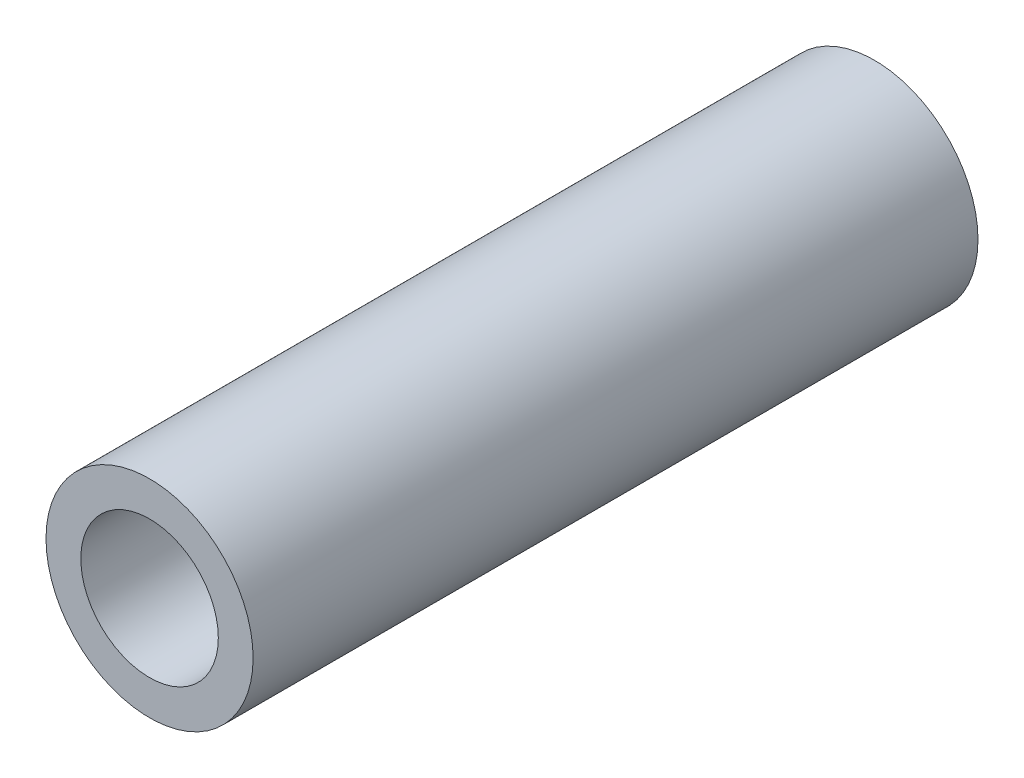
ISO-10303-21;
HEADER;
FILE_DESCRIPTION(('STEP AP214'),'2;1');
FILE_NAME('part.step','',(''),(''),'','','');
FILE_SCHEMA(('AUTOMOTIVE_DESIGN { 1 0 10303 214 1 1 1 1 }'));
ENDSEC;
DATA;
#1=APPLICATION_CONTEXT('core data for automotive mechanical design processes');
#2=APPLICATION_PROTOCOL_DEFINITION('international standard','automotive_design',2000,#1);
#3=PRODUCT_CONTEXT('',#1,'mechanical');
#4=PRODUCT('Part','Part','',(#3));
#5=PRODUCT_RELATED_PRODUCT_CATEGORY('part','',(#4));
#6=PRODUCT_DEFINITION_FORMATION('','',#4);
#7=PRODUCT_DEFINITION_CONTEXT('part definition',#1,'design');
#8=PRODUCT_DEFINITION('design','',#6,#7);
#9=PRODUCT_DEFINITION_SHAPE('','',#8);
#10=(LENGTH_UNIT() NAMED_UNIT(*) SI_UNIT(.MILLI.,.METRE.));
#11=(NAMED_UNIT(*) PLANE_ANGLE_UNIT() SI_UNIT($,.RADIAN.));
#12=(NAMED_UNIT(*) SI_UNIT($,.STERADIAN.) SOLID_ANGLE_UNIT());
#13=UNCERTAINTY_MEASURE_WITH_UNIT(LENGTH_MEASURE(1.E-05),#10,'distance_accuracy_value','');
#14=(GEOMETRIC_REPRESENTATION_CONTEXT(3) GLOBAL_UNCERTAINTY_ASSIGNED_CONTEXT((#13)) GLOBAL_UNIT_ASSIGNED_CONTEXT((#10,
#11,#12)) REPRESENTATION_CONTEXT('',''));
#15=CARTESIAN_POINT('',(0.,0.,0.));
#16=DIRECTION('',(0.,0.,1.));
#17=DIRECTION('',(1.,0.,0.));
#18=AXIS2_PLACEMENT_3D('',#15,#16,#17);
#19=CARTESIAN_POINT('',(0.,0.,11.1125));
#20=DIRECTION('',(0.,0.,1.));
#21=DIRECTION('',(1.,0.,0.));
#22=AXIS2_PLACEMENT_3D('',#19,#20,#21);
#23=PLANE('',#22);
#24=CARTESIAN_POINT('',(0.,0.,11.1125));
#25=DIRECTION('',(0.,0.,1.));
#26=DIRECTION('',(1.,0.,0.));
#27=AXIS2_PLACEMENT_3D('',#24,#25,#26);
#28=CIRCLE('',#27,3.175);
#29=CARTESIAN_POINT('',(3.175,0.,11.1125));
#30=VERTEX_POINT('',#29);
#31=EDGE_CURVE('E10',#30,#30,#28,.T.);
#32=ORIENTED_EDGE('',*,*,#31,.T.);
#33=EDGE_LOOP('',(#32));
#34=FACE_BOUND('',#33,.T.);
#35=CARTESIAN_POINT('',(0.,0.,11.1125));
#36=DIRECTION('',(0.,0.,1.));
#37=DIRECTION('',(1.,0.,0.));
#38=AXIS2_PLACEMENT_3D('',#35,#36,#37);
#39=CIRCLE('',#38,2.1082);
#40=CARTESIAN_POINT('',(2.1082,0.,11.1125));
#41=VERTEX_POINT('',#40);
#42=EDGE_CURVE('E41',#41,#41,#39,.T.);
#43=ORIENTED_EDGE('',*,*,#42,.F.);
#44=EDGE_LOOP('',(#43));
#45=FACE_BOUND('',#44,.T.);
#46=ADVANCED_FACE('F30',(#34,#45),#23,.T.);
#47=CARTESIAN_POINT('',(0.,0.,-11.1125));
#48=DIRECTION('',(0.,0.,1.));
#49=DIRECTION('',(1.,0.,0.));
#50=AXIS2_PLACEMENT_3D('',#47,#48,#49);
#51=PLANE('',#50);
#52=CARTESIAN_POINT('',(0.,0.,-11.1125));
#53=DIRECTION('',(0.,0.,1.));
#54=DIRECTION('',(1.,0.,0.));
#55=AXIS2_PLACEMENT_3D('',#52,#53,#54);
#56=CIRCLE('',#55,3.175);
#57=CARTESIAN_POINT('',(3.175,0.,-11.1125));
#58=VERTEX_POINT('',#57);
#59=EDGE_CURVE('E34',#58,#58,#56,.T.);
#60=ORIENTED_EDGE('',*,*,#59,.F.);
#61=EDGE_LOOP('',(#60));
#62=FACE_BOUND('',#61,.T.);
#63=CARTESIAN_POINT('',(0.,0.,-11.1125));
#64=DIRECTION('',(0.,0.,1.));
#65=DIRECTION('',(1.,0.,0.));
#66=AXIS2_PLACEMENT_3D('',#63,#64,#65);
#67=CIRCLE('',#66,2.1082);
#68=CARTESIAN_POINT('',(2.1082,0.,-11.1125));
#69=VERTEX_POINT('',#68);
#70=EDGE_CURVE('E43',#69,#69,#67,.T.);
#71=ORIENTED_EDGE('',*,*,#70,.T.);
#72=EDGE_LOOP('',(#71));
#73=FACE_BOUND('',#72,.T.);
#74=ADVANCED_FACE('F53',(#62,#73),#51,.F.);
#75=CARTESIAN_POINT('',(0.,0.,11.1125));
#76=DIRECTION('',(0.,0.,-1.));
#77=DIRECTION('',(-1.,0.,0.));
#78=AXIS2_PLACEMENT_3D('',#75,#76,#77);
#79=CYLINDRICAL_SURFACE('',#78,3.175);
#80=ORIENTED_EDGE('',*,*,#31,.F.);
#81=EDGE_LOOP('',(#80));
#82=FACE_BOUND('',#81,.T.);
#83=ORIENTED_EDGE('',*,*,#59,.T.);
#84=EDGE_LOOP('',(#83));
#85=FACE_BOUND('',#84,.T.);
#86=ADVANCED_FACE('F32',(#82,#85),#79,.T.);
#87=CARTESIAN_POINT('',(0.,0.,11.1125));
#88=DIRECTION('',(0.,0.,-1.));
#89=DIRECTION('',(-1.,0.,0.));
#90=AXIS2_PLACEMENT_3D('',#87,#88,#89);
#91=CYLINDRICAL_SURFACE('',#90,2.1082);
#92=ORIENTED_EDGE('',*,*,#42,.T.);
#93=EDGE_LOOP('',(#92));
#94=FACE_BOUND('',#93,.T.);
#95=ORIENTED_EDGE('',*,*,#70,.F.);
#96=EDGE_LOOP('',(#95));
#97=FACE_BOUND('',#96,.T.);
#98=ADVANCED_FACE('F49',(#94,#97),#91,.F.);
#99=CLOSED_SHELL('',(#46,#74,#86,#98));
#100=MANIFOLD_SOLID_BREP('B2',#99);
#101=ADVANCED_BREP_SHAPE_REPRESENTATION('',(#18,#100),#14);
#102=SHAPE_DEFINITION_REPRESENTATION(#9,#101);
ENDSEC;
END-ISO-10303-21;
